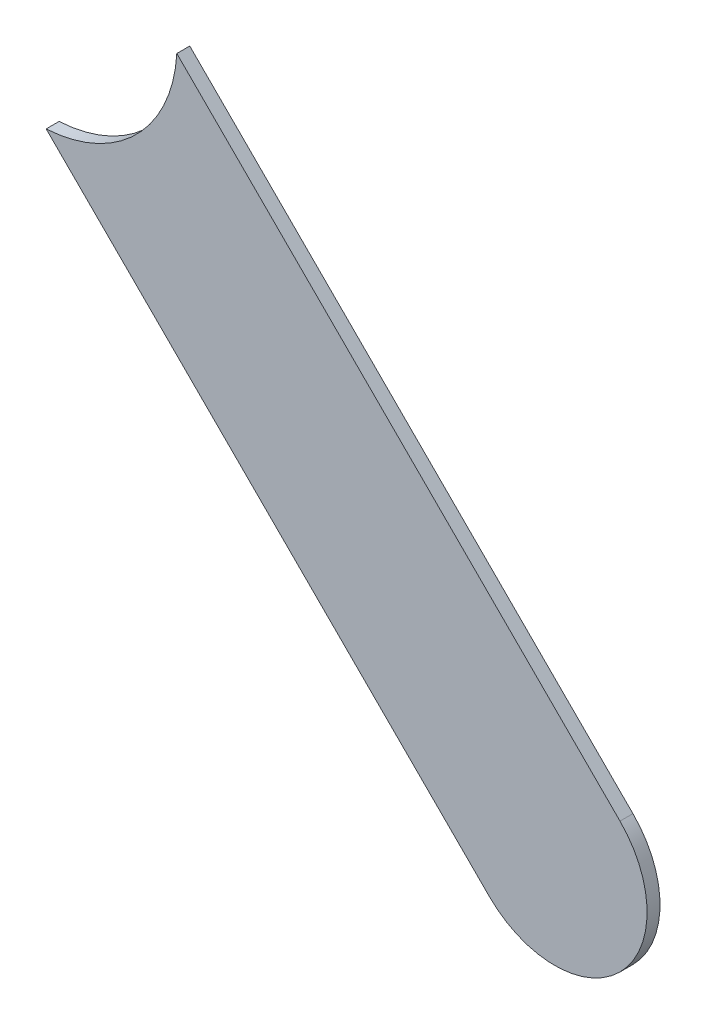
ISO-10303-21;
HEADER;
FILE_DESCRIPTION(('STEP AP214'),'2;1');
FILE_NAME('part.step','',(''),(''),'','','');
FILE_SCHEMA(('AUTOMOTIVE_DESIGN { 1 0 10303 214 1 1 1 1 }'));
ENDSEC;
DATA;
#1=APPLICATION_CONTEXT('core data for automotive mechanical design processes');
#2=APPLICATION_PROTOCOL_DEFINITION('international standard','automotive_design',2000,#1);
#3=PRODUCT_CONTEXT('',#1,'mechanical');
#4=PRODUCT('Part','Part','',(#3));
#5=PRODUCT_RELATED_PRODUCT_CATEGORY('part','',(#4));
#6=PRODUCT_DEFINITION_FORMATION('','',#4);
#7=PRODUCT_DEFINITION_CONTEXT('part definition',#1,'design');
#8=PRODUCT_DEFINITION('design','',#6,#7);
#9=PRODUCT_DEFINITION_SHAPE('','',#8);
#10=(LENGTH_UNIT() NAMED_UNIT(*) SI_UNIT(.MILLI.,.METRE.));
#11=(NAMED_UNIT(*) PLANE_ANGLE_UNIT() SI_UNIT($,.RADIAN.));
#12=(NAMED_UNIT(*) SI_UNIT($,.STERADIAN.) SOLID_ANGLE_UNIT());
#13=UNCERTAINTY_MEASURE_WITH_UNIT(LENGTH_MEASURE(1.E-05),#10,'distance_accuracy_value','');
#14=(GEOMETRIC_REPRESENTATION_CONTEXT(3) GLOBAL_UNCERTAINTY_ASSIGNED_CONTEXT((#13)) GLOBAL_UNIT_ASSIGNED_CONTEXT((#10,
#11,#12)) REPRESENTATION_CONTEXT('',''));
#15=CARTESIAN_POINT('',(0.,0.,0.));
#16=DIRECTION('',(0.,0.,1.));
#17=DIRECTION('',(1.,0.,0.));
#18=AXIS2_PLACEMENT_3D('',#15,#16,#17);
#19=CARTESIAN_POINT('',(168.070776,-144.857223,-0.035));
#20=DIRECTION('',(-0.707106781186548,-0.707106781186548,0.));
#21=DIRECTION('',(-0.707106781186548,0.707106781186548,0.));
#22=AXIS2_PLACEMENT_3D('',#19,#20,#21);
#23=PLANE('',#22);
#24=DIRECTION('',(0.,0.,-1.));
#25=VECTOR('',#24,1.);
#26=CARTESIAN_POINT('',(166.87141902843,-143.6578660284,-0.045));
#27=LINE('',#26,#25);
#28=CARTESIAN_POINT('',(166.87141902844,-143.6578660284,0.));
#29=VERTEX_POINT('',#28);
#30=CARTESIAN_POINT('',(166.87141902844,-143.6578660284,-0.035));
#31=VERTEX_POINT('',#30);
#32=EDGE_CURVE('E11',#29,#31,#27,.T.);
#33=ORIENTED_EDGE('',*,*,#32,.F.);
#34=DIRECTION('',(-0.707106781186548,0.707106781186548,0.));
#35=VECTOR('',#34,1.);
#36=CARTESIAN_POINT('',(168.070776,-144.857223,0.));
#37=LINE('',#36,#35);
#38=CARTESIAN_POINT('',(168.070776,-144.857223,0.));
#39=VERTEX_POINT('',#38);
#40=EDGE_CURVE('E20',#39,#29,#37,.T.);
#41=ORIENTED_EDGE('',*,*,#40,.F.);
#42=DIRECTION('',(0.,0.,1.));
#43=VECTOR('',#42,1.);
#44=CARTESIAN_POINT('',(168.070776,-144.857223,-0.035));
#45=LINE('',#44,#43);
#46=CARTESIAN_POINT('',(168.070776,-144.857223,-0.035));
#47=VERTEX_POINT('',#46);
#48=EDGE_CURVE('E90',#47,#39,#45,.T.);
#49=ORIENTED_EDGE('',*,*,#48,.F.);
#50=DIRECTION('',(-0.707106781186548,0.707106781186548,0.));
#51=VECTOR('',#50,1.);
#52=CARTESIAN_POINT('',(168.070776,-144.857223,-0.035));
#53=LINE('',#52,#51);
#54=EDGE_CURVE('E86',#47,#31,#53,.T.);
#55=ORIENTED_EDGE('',*,*,#54,.T.);
#56=EDGE_LOOP('',(#33,#41,#49,#55));
#57=FACE_BOUND('',#56,.T.);
#58=ADVANCED_FACE('F17',(#57),#23,.F.);
#59=CARTESIAN_POINT('',(166.497,-143.637,-0.045));
#60=DIRECTION('',(0.,0.,-1.));
#61=DIRECTION('',(0.,-1.,0.));
#62=AXIS2_PLACEMENT_3D('',#59,#60,#61);
#63=CYLINDRICAL_SURFACE('',#62,0.375);
#64=DIRECTION('',(0.,0.,-1.));
#65=VECTOR('',#64,1.);
#66=CARTESIAN_POINT('',(166.51786602843,-144.0114190284,-0.045));
#67=LINE('',#66,#65);
#68=CARTESIAN_POINT('',(166.51786602846,-144.0114190284,0.));
#69=VERTEX_POINT('',#68);
#70=CARTESIAN_POINT('',(166.51786602846,-144.0114190284,-0.035));
#71=VERTEX_POINT('',#70);
#72=EDGE_CURVE('E100',#69,#71,#67,.T.);
#73=ORIENTED_EDGE('',*,*,#72,.F.);
#74=CARTESIAN_POINT('',(166.497,-143.637,0.));
#75=DIRECTION('',(0.,0.,-1.));
#76=DIRECTION('',(0.,-1.,0.));
#77=AXIS2_PLACEMENT_3D('',#74,#75,#76);
#78=CIRCLE('',#77,0.375);
#79=EDGE_CURVE('E53',#29,#69,#78,.T.);
#80=ORIENTED_EDGE('',*,*,#79,.F.);
#81=ORIENTED_EDGE('',*,*,#32,.T.);
#82=CARTESIAN_POINT('',(166.497,-143.637,-0.035));
#83=DIRECTION('',(0.,0.,-1.));
#84=DIRECTION('',(0.,-1.,0.));
#85=AXIS2_PLACEMENT_3D('',#82,#83,#84);
#86=CIRCLE('',#85,0.375);
#87=EDGE_CURVE('E84',#31,#71,#86,.T.);
#88=ORIENTED_EDGE('',*,*,#87,.T.);
#89=EDGE_LOOP('',(#73,#80,#81,#88));
#90=FACE_BOUND('',#89,.T.);
#91=ADVANCED_FACE('F83',(#90),#63,.F.);
#92=CARTESIAN_POINT('',(166.320223,-143.813776,0.));
#93=DIRECTION('',(0.,0.,1.));
#94=DIRECTION('',(1.,0.,0.));
#95=AXIS2_PLACEMENT_3D('',#92,#93,#94);
#96=PLANE('',#95);
#97=ORIENTED_EDGE('',*,*,#79,.T.);
#98=DIRECTION('',(0.707106781186548,-0.707106781186548,0.));
#99=VECTOR('',#98,1.);
#100=CARTESIAN_POINT('',(166.320223,-143.813776,0.));
#101=LINE('',#100,#99);
#102=CARTESIAN_POINT('',(167.717223,-145.210776,0.));
#103=VERTEX_POINT('',#102);
#104=EDGE_CURVE('E113',#69,#103,#101,.T.);
#105=ORIENTED_EDGE('',*,*,#104,.T.);
#106=CARTESIAN_POINT('',(167.8939995,-145.0339995,0.));
#107=DIRECTION('',(0.,0.,1.));
#108=DIRECTION('',(-0.707106781186548,-0.707106781186548,0.));
#109=AXIS2_PLACEMENT_3D('',#106,#107,#108);
#110=CIRCLE('',#109,0.249999723809);
#111=EDGE_CURVE('E65',#103,#39,#110,.T.);
#112=ORIENTED_EDGE('',*,*,#111,.T.);
#113=ORIENTED_EDGE('',*,*,#40,.T.);
#114=EDGE_LOOP('',(#97,#105,#112,#113));
#115=FACE_BOUND('',#114,.T.);
#116=ADVANCED_FACE('F127',(#115),#96,.T.);
#117=CARTESIAN_POINT('',(167.8939995,-145.0339995,-0.035));
#118=DIRECTION('',(0.,0.,-1.));
#119=DIRECTION('',(-0.707106781186548,-0.707106781186548,0.));
#120=AXIS2_PLACEMENT_3D('',#117,#118,#119);
#121=CYLINDRICAL_SURFACE('',#120,0.249999723809);
#122=CARTESIAN_POINT('',(167.8939995,-145.0339995,-0.035));
#123=DIRECTION('',(0.,0.,1.));
#124=DIRECTION('',(-0.707106781186548,-0.707106781186548,0.));
#125=AXIS2_PLACEMENT_3D('',#122,#123,#124);
#126=CIRCLE('',#125,0.249999723809);
#127=CARTESIAN_POINT('',(167.717223,-145.210776,-0.035));
#128=VERTEX_POINT('',#127);
#129=EDGE_CURVE('E73',#128,#47,#126,.T.);
#130=ORIENTED_EDGE('',*,*,#129,.T.);
#131=ORIENTED_EDGE('',*,*,#48,.T.);
#132=ORIENTED_EDGE('',*,*,#111,.F.);
#133=DIRECTION('',(0.,0.,1.));
#134=VECTOR('',#133,1.);
#135=CARTESIAN_POINT('',(167.717223,-145.210776,-0.035));
#136=LINE('',#135,#134);
#137=EDGE_CURVE('E117',#128,#103,#136,.T.);
#138=ORIENTED_EDGE('',*,*,#137,.F.);
#139=EDGE_LOOP('',(#130,#131,#132,#138));
#140=FACE_BOUND('',#139,.T.);
#141=ADVANCED_FACE('F125',(#140),#121,.T.);
#142=CARTESIAN_POINT('',(166.320223,-143.813776,-0.035));
#143=DIRECTION('',(0.,0.,1.));
#144=DIRECTION('',(1.,0.,0.));
#145=AXIS2_PLACEMENT_3D('',#142,#143,#144);
#146=PLANE('',#145);
#147=ORIENTED_EDGE('',*,*,#54,.F.);
#148=ORIENTED_EDGE('',*,*,#129,.F.);
#149=DIRECTION('',(0.707106781186548,-0.707106781186548,0.));
#150=VECTOR('',#149,1.);
#151=CARTESIAN_POINT('',(166.320223,-143.813776,-0.035));
#152=LINE('',#151,#150);
#153=EDGE_CURVE('E87',#71,#128,#152,.T.);
#154=ORIENTED_EDGE('',*,*,#153,.F.);
#155=ORIENTED_EDGE('',*,*,#87,.F.);
#156=EDGE_LOOP('',(#147,#148,#154,#155));
#157=FACE_BOUND('',#156,.T.);
#158=ADVANCED_FACE('F85',(#157),#146,.F.);
#159=CARTESIAN_POINT('',(166.320223,-143.813776,-0.035));
#160=DIRECTION('',(0.707106781186548,0.707106781186548,0.));
#161=DIRECTION('',(0.,0.,-1.));
#162=AXIS2_PLACEMENT_3D('',#159,#160,#161);
#163=PLANE('',#162);
#164=ORIENTED_EDGE('',*,*,#137,.T.);
#165=ORIENTED_EDGE('',*,*,#104,.F.);
#166=ORIENTED_EDGE('',*,*,#72,.T.);
#167=ORIENTED_EDGE('',*,*,#153,.T.);
#168=EDGE_LOOP('',(#164,#165,#166,#167));
#169=FACE_BOUND('',#168,.T.);
#170=ADVANCED_FACE('F124',(#169),#163,.F.);
#171=CLOSED_SHELL('',(#58,#91,#116,#141,#158,#170));
#172=MANIFOLD_SOLID_BREP('B1',#171);
#173=ADVANCED_BREP_SHAPE_REPRESENTATION('',(#18,#172),#14);
#174=SHAPE_DEFINITION_REPRESENTATION(#9,#173);
ENDSEC;
END-ISO-10303-21;
